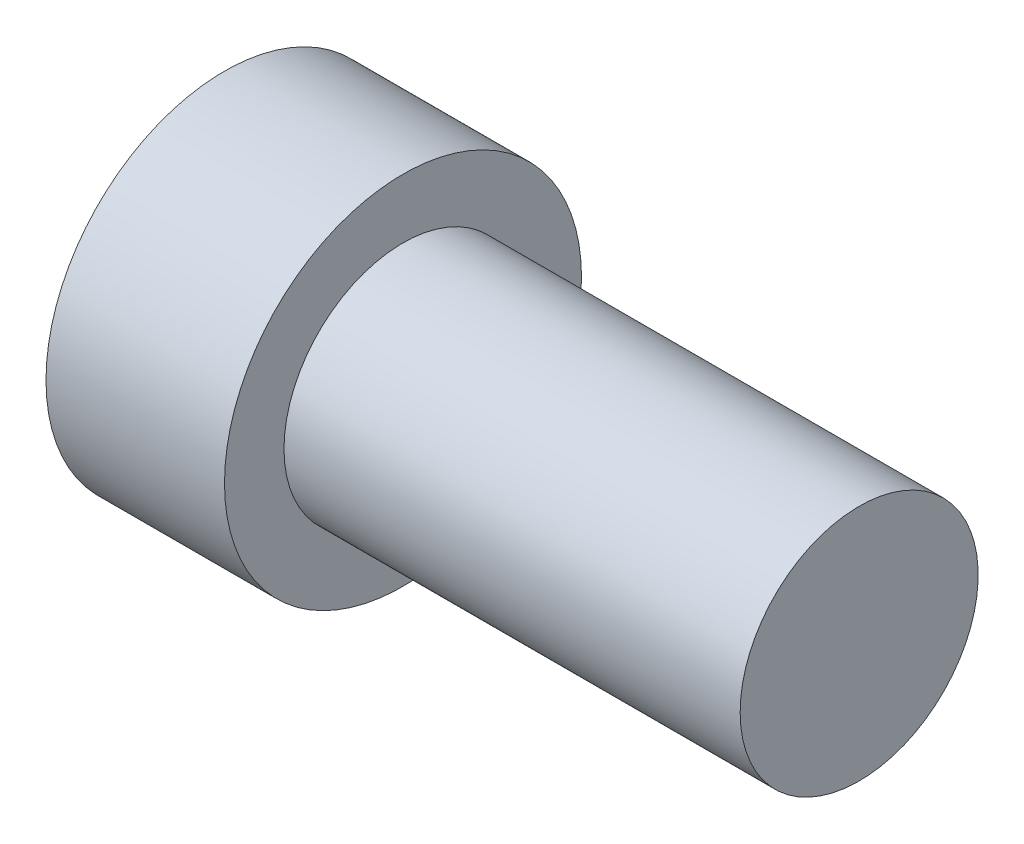
ISO-10303-21;
HEADER;
FILE_DESCRIPTION(('STEP AP214'),'2;1');
FILE_NAME('part.step','',(''),(''),'','','');
FILE_SCHEMA(('AUTOMOTIVE_DESIGN { 1 0 10303 214 1 1 1 1 }'));
ENDSEC;
DATA;
#1=APPLICATION_CONTEXT('core data for automotive mechanical design processes');
#2=APPLICATION_PROTOCOL_DEFINITION('international standard','automotive_design',2000,#1);
#3=PRODUCT_CONTEXT('',#1,'mechanical');
#4=PRODUCT('Part','Part','',(#3));
#5=PRODUCT_RELATED_PRODUCT_CATEGORY('part','',(#4));
#6=PRODUCT_DEFINITION_FORMATION('','',#4);
#7=PRODUCT_DEFINITION_CONTEXT('part definition',#1,'design');
#8=PRODUCT_DEFINITION('design','',#6,#7);
#9=PRODUCT_DEFINITION_SHAPE('','',#8);
#10=(LENGTH_UNIT() NAMED_UNIT(*) SI_UNIT(.MILLI.,.METRE.));
#11=(NAMED_UNIT(*) PLANE_ANGLE_UNIT() SI_UNIT($,.RADIAN.));
#12=(NAMED_UNIT(*) SI_UNIT($,.STERADIAN.) SOLID_ANGLE_UNIT());
#13=UNCERTAINTY_MEASURE_WITH_UNIT(LENGTH_MEASURE(1.E-05),#10,'distance_accuracy_value','');
#14=(GEOMETRIC_REPRESENTATION_CONTEXT(3) GLOBAL_UNCERTAINTY_ASSIGNED_CONTEXT((#13)) GLOBAL_UNIT_ASSIGNED_CONTEXT((#10,
#11,#12)) REPRESENTATION_CONTEXT('',''));
#15=CARTESIAN_POINT('',(0.,0.,0.));
#16=DIRECTION('',(0.,0.,1.));
#17=DIRECTION('',(1.,0.,0.));
#18=AXIS2_PLACEMENT_3D('',#15,#16,#17);
#19=CARTESIAN_POINT('',(0.,0.,-9.));
#20=DIRECTION('',(1.,0.,0.));
#21=DIRECTION('',(0.,0.,-1.));
#22=AXIS2_PLACEMENT_3D('',#19,#20,#21);
#23=PLANE('',#22);
#24=CARTESIAN_POINT('',(0.,0.,0.));
#25=DIRECTION('',(-1.,0.,0.));
#26=DIRECTION('',(0.,0.,1.));
#27=AXIS2_PLACEMENT_3D('',#24,#25,#26);
#28=CIRCLE('',#27,2.5);
#29=CARTESIAN_POINT('',(0.,0.,2.5));
#30=VERTEX_POINT('',#29);
#31=EDGE_CURVE('E53',#30,#30,#28,.T.);
#32=ORIENTED_EDGE('',*,*,#31,.F.);
#33=EDGE_LOOP('',(#32));
#34=FACE_BOUND('',#33,.T.);
#35=CARTESIAN_POINT('',(0.,0.,0.));
#36=DIRECTION('',(-1.,0.,0.));
#37=DIRECTION('',(0.,0.,1.));
#38=AXIS2_PLACEMENT_3D('',#35,#36,#37);
#39=CIRCLE('',#38,9.);
#40=CARTESIAN_POINT('',(0.,0.,9.));
#41=VERTEX_POINT('',#40);
#42=EDGE_CURVE('E47',#41,#41,#39,.T.);
#43=ORIENTED_EDGE('',*,*,#42,.T.);
#44=EDGE_LOOP('',(#43));
#45=FACE_BOUND('',#44,.T.);
#46=ADVANCED_FACE('F33',(#34,#45),#23,.F.);
#47=CARTESIAN_POINT('',(32.,0.,0.));
#48=DIRECTION('',(-1.,0.,0.));
#49=DIRECTION('',(0.,0.,1.));
#50=AXIS2_PLACEMENT_3D('',#47,#48,#49);
#51=PLANE('',#50);
#52=CARTESIAN_POINT('',(32.,0.,0.));
#53=DIRECTION('',(-1.,0.,0.));
#54=DIRECTION('',(0.,0.,1.));
#55=AXIS2_PLACEMENT_3D('',#52,#53,#54);
#56=CIRCLE('',#55,6.);
#57=CARTESIAN_POINT('',(32.,0.,6.));
#58=VERTEX_POINT('',#57);
#59=EDGE_CURVE('E10',#58,#58,#56,.T.);
#60=ORIENTED_EDGE('',*,*,#59,.F.);
#61=EDGE_LOOP('',(#60));
#62=FACE_BOUND('',#61,.T.);
#63=ADVANCED_FACE('F70',(#62),#51,.F.);
#64=CARTESIAN_POINT('',(0.,0.,0.));
#65=DIRECTION('',(-1.,0.,0.));
#66=DIRECTION('',(0.,0.,1.));
#67=AXIS2_PLACEMENT_3D('',#64,#65,#66);
#68=CYLINDRICAL_SURFACE('',#67,6.);
#69=CARTESIAN_POINT('',(9.,0.,0.));
#70=DIRECTION('',(-1.,0.,0.));
#71=DIRECTION('',(0.,0.,1.));
#72=AXIS2_PLACEMENT_3D('',#69,#70,#71);
#73=CIRCLE('',#72,6.);
#74=CARTESIAN_POINT('',(9.,0.,6.));
#75=VERTEX_POINT('',#74);
#76=EDGE_CURVE('E39',#75,#75,#73,.T.);
#77=ORIENTED_EDGE('',*,*,#76,.F.);
#78=EDGE_LOOP('',(#77));
#79=FACE_BOUND('',#78,.T.);
#80=ORIENTED_EDGE('',*,*,#59,.T.);
#81=EDGE_LOOP('',(#80));
#82=FACE_BOUND('',#81,.T.);
#83=ADVANCED_FACE('F80',(#79,#82),#68,.T.);
#84=CARTESIAN_POINT('',(9.,0.,-6.));
#85=DIRECTION('',(-1.,0.,0.));
#86=DIRECTION('',(0.,0.,1.));
#87=AXIS2_PLACEMENT_3D('',#84,#85,#86);
#88=PLANE('',#87);
#89=CARTESIAN_POINT('',(9.,0.,0.));
#90=DIRECTION('',(-1.,0.,0.));
#91=DIRECTION('',(0.,0.,1.));
#92=AXIS2_PLACEMENT_3D('',#89,#90,#91);
#93=CIRCLE('',#92,9.);
#94=CARTESIAN_POINT('',(9.,0.,9.));
#95=VERTEX_POINT('',#94);
#96=EDGE_CURVE('E43',#95,#95,#93,.T.);
#97=ORIENTED_EDGE('',*,*,#96,.F.);
#98=EDGE_LOOP('',(#97));
#99=FACE_BOUND('',#98,.T.);
#100=ORIENTED_EDGE('',*,*,#76,.T.);
#101=EDGE_LOOP('',(#100));
#102=FACE_BOUND('',#101,.T.);
#103=ADVANCED_FACE('F75',(#99,#102),#88,.F.);
#104=CARTESIAN_POINT('',(0.,0.,0.));
#105=DIRECTION('',(-1.,0.,0.));
#106=DIRECTION('',(0.,0.,1.));
#107=AXIS2_PLACEMENT_3D('',#104,#105,#106);
#108=CYLINDRICAL_SURFACE('',#107,9.);
#109=ORIENTED_EDGE('',*,*,#42,.F.);
#110=EDGE_LOOP('',(#109));
#111=FACE_BOUND('',#110,.T.);
#112=ORIENTED_EDGE('',*,*,#96,.T.);
#113=EDGE_LOOP('',(#112));
#114=FACE_BOUND('',#113,.T.);
#115=ADVANCED_FACE('F64',(#111,#114),#108,.T.);
#116=CARTESIAN_POINT('',(20.5,0.,0.));
#117=DIRECTION('',(-1.,0.,0.));
#118=DIRECTION('',(0.,0.,1.));
#119=AXIS2_PLACEMENT_3D('',#116,#117,#118);
#120=CYLINDRICAL_SURFACE('',#119,2.5);
#121=CARTESIAN_POINT('',(20.5,0.,0.));
#122=DIRECTION('',(-1.,0.,0.));
#123=DIRECTION('',(0.,0.,1.));
#124=AXIS2_PLACEMENT_3D('',#121,#122,#123);
#125=CIRCLE('',#124,2.5);
#126=CARTESIAN_POINT('',(20.5,0.,2.5));
#127=VERTEX_POINT('',#126);
#128=EDGE_CURVE('E52',#127,#127,#125,.T.);
#129=ORIENTED_EDGE('',*,*,#128,.F.);
#130=EDGE_LOOP('',(#129));
#131=FACE_BOUND('',#130,.T.);
#132=ORIENTED_EDGE('',*,*,#31,.T.);
#133=EDGE_LOOP('',(#132));
#134=FACE_BOUND('',#133,.T.);
#135=ADVANCED_FACE('F61',(#131,#134),#120,.F.);
#136=CARTESIAN_POINT('',(20.5,0.,0.));
#137=DIRECTION('',(-1.,0.,0.));
#138=DIRECTION('',(0.,0.,1.));
#139=AXIS2_PLACEMENT_3D('',#136,#137,#138);
#140=PLANE('',#139);
#141=ORIENTED_EDGE('',*,*,#128,.T.);
#142=EDGE_LOOP('',(#141));
#143=FACE_BOUND('',#142,.T.);
#144=ADVANCED_FACE('F59',(#143),#140,.T.);
#145=CLOSED_SHELL('',(#46,#63,#83,#103,#115,#135,#144));
#146=MANIFOLD_SOLID_BREP('B2',#145);
#147=ADVANCED_BREP_SHAPE_REPRESENTATION('',(#18,#146),#14);
#148=SHAPE_DEFINITION_REPRESENTATION(#9,#147);
ENDSEC;
END-ISO-10303-21;
